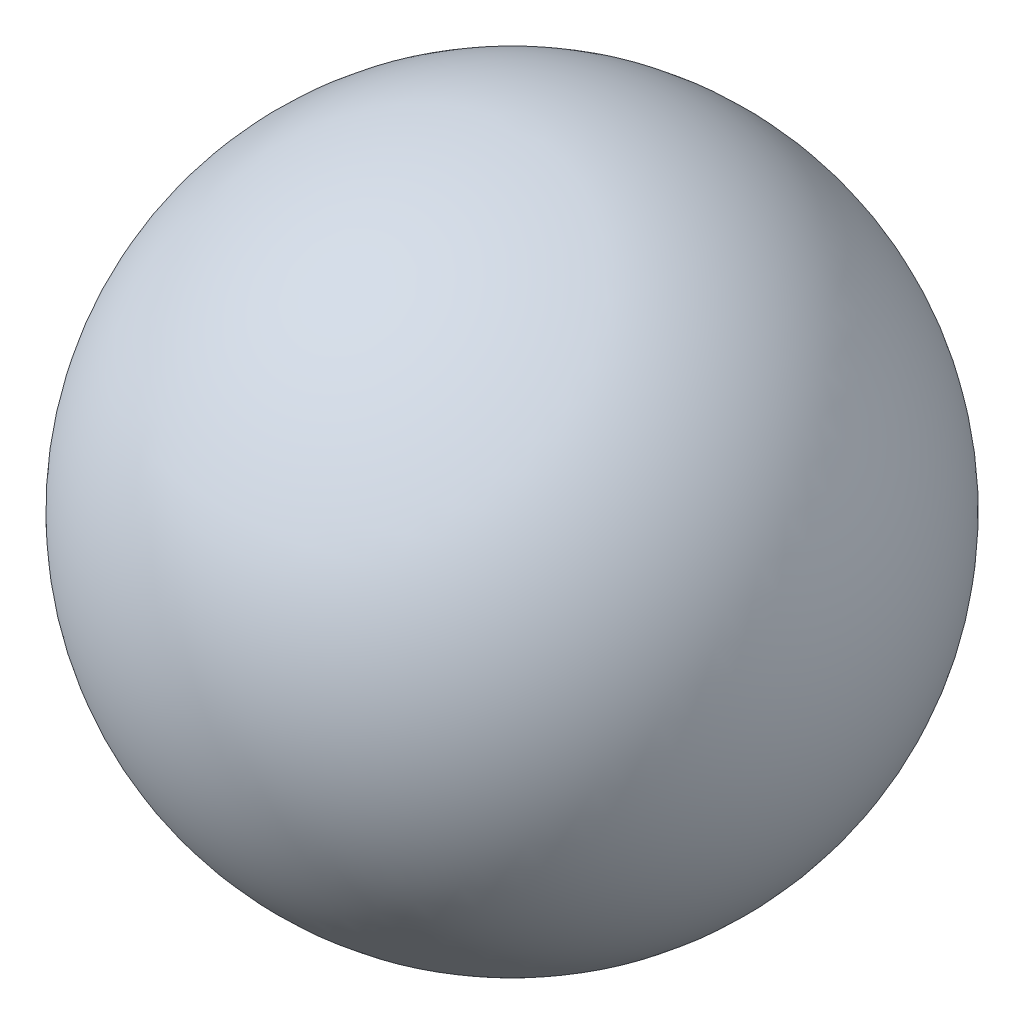
ISO-10303-21;
HEADER;
FILE_DESCRIPTION(('STEP AP214'),'2;1');
FILE_NAME('part.step','',(''),(''),'','','');
FILE_SCHEMA(('AUTOMOTIVE_DESIGN { 1 0 10303 214 1 1 1 1 }'));
ENDSEC;
DATA;
#1=APPLICATION_CONTEXT('core data for automotive mechanical design processes');
#2=APPLICATION_PROTOCOL_DEFINITION('international standard','automotive_design',2000,#1);
#3=PRODUCT_CONTEXT('',#1,'mechanical');
#4=PRODUCT('Part','Part','',(#3));
#5=PRODUCT_RELATED_PRODUCT_CATEGORY('part','',(#4));
#6=PRODUCT_DEFINITION_FORMATION('','',#4);
#7=PRODUCT_DEFINITION_CONTEXT('part definition',#1,'design');
#8=PRODUCT_DEFINITION('design','',#6,#7);
#9=PRODUCT_DEFINITION_SHAPE('','',#8);
#10=(LENGTH_UNIT() NAMED_UNIT(*) SI_UNIT(.MILLI.,.METRE.));
#11=(NAMED_UNIT(*) PLANE_ANGLE_UNIT() SI_UNIT($,.RADIAN.));
#12=(NAMED_UNIT(*) SI_UNIT($,.STERADIAN.) SOLID_ANGLE_UNIT());
#13=UNCERTAINTY_MEASURE_WITH_UNIT(LENGTH_MEASURE(1.E-05),#10,'distance_accuracy_value','');
#14=(GEOMETRIC_REPRESENTATION_CONTEXT(3) GLOBAL_UNCERTAINTY_ASSIGNED_CONTEXT((#13)) GLOBAL_UNIT_ASSIGNED_CONTEXT((#10,
#11,#12)) REPRESENTATION_CONTEXT('',''));
#15=CARTESIAN_POINT('',(0.,0.,0.));
#16=DIRECTION('',(0.,0.,1.));
#17=DIRECTION('',(1.,0.,0.));
#18=AXIS2_PLACEMENT_3D('',#15,#16,#17);
#19=CARTESIAN_POINT('',(-2.86057615559,0.,1.377580871698));
#20=DIRECTION('',(0.,-1.,0.));
#21=DIRECTION('',(-0.433883739117599,0.,-0.900968867902399));
#22=AXIS2_PLACEMENT_3D('',#19,#20,#21);
#23=SPHERICAL_SURFACE('',#22,0.794);
#24=CARTESIAN_POINT('',(-2.86057615559,-0.794,1.377580871698));
#25=VERTEX_POINT('',#24);
#26=VERTEX_LOOP('',#25);
#27=FACE_BOUND('',#26,.T.);
#28=ADVANCED_FACE('F12',(#27),#23,.T.);
#29=CLOSED_SHELL('',(#28));
#30=MANIFOLD_SOLID_BREP('B1',#29);
#31=ADVANCED_BREP_SHAPE_REPRESENTATION('',(#18,#30),#14);
#32=SHAPE_DEFINITION_REPRESENTATION(#9,#31);
ENDSEC;
END-ISO-10303-21;
